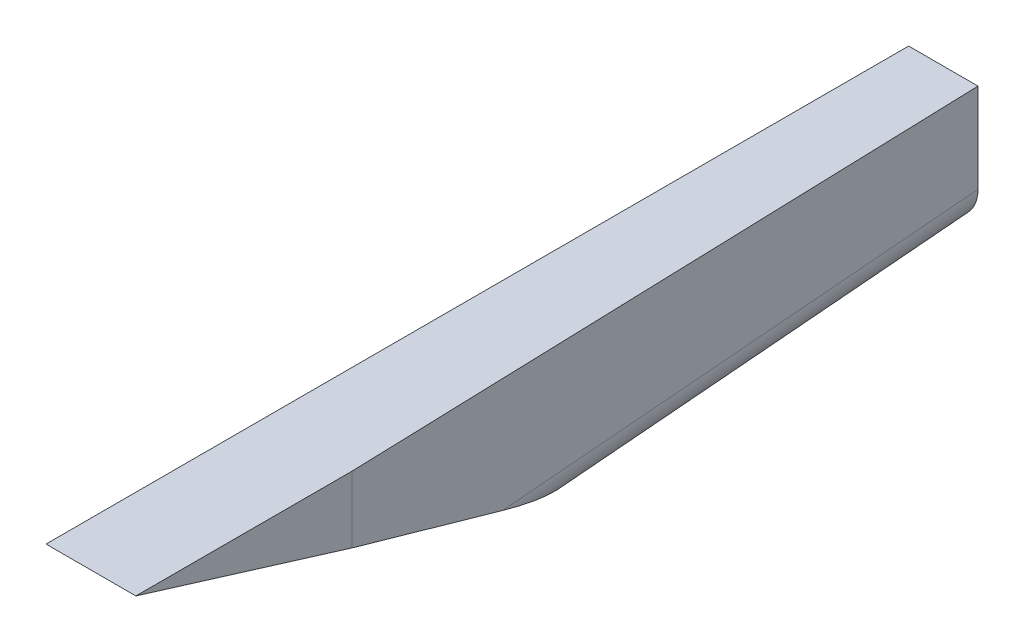
ISO-10303-21;
HEADER;
FILE_DESCRIPTION(('STEP AP214'),'2;1');
FILE_NAME('part.step','',(''),(''),'','','');
FILE_SCHEMA(('AUTOMOTIVE_DESIGN { 1 0 10303 214 1 1 1 1 }'));
ENDSEC;
DATA;
#1=APPLICATION_CONTEXT('core data for automotive mechanical design processes');
#2=APPLICATION_PROTOCOL_DEFINITION('international standard','automotive_design',2000,#1);
#3=PRODUCT_CONTEXT('',#1,'mechanical');
#4=PRODUCT('Part','Part','',(#3));
#5=PRODUCT_RELATED_PRODUCT_CATEGORY('part','',(#4));
#6=PRODUCT_DEFINITION_FORMATION('','',#4);
#7=PRODUCT_DEFINITION_CONTEXT('part definition',#1,'design');
#8=PRODUCT_DEFINITION('design','',#6,#7);
#9=PRODUCT_DEFINITION_SHAPE('','',#8);
#10=(LENGTH_UNIT() NAMED_UNIT(*) SI_UNIT(.MILLI.,.METRE.));
#11=(NAMED_UNIT(*) PLANE_ANGLE_UNIT() SI_UNIT($,.RADIAN.));
#12=(NAMED_UNIT(*) SI_UNIT($,.STERADIAN.) SOLID_ANGLE_UNIT());
#13=UNCERTAINTY_MEASURE_WITH_UNIT(LENGTH_MEASURE(1.E-05),#10,'distance_accuracy_value','');
#14=(GEOMETRIC_REPRESENTATION_CONTEXT(3) GLOBAL_UNCERTAINTY_ASSIGNED_CONTEXT((#13)) GLOBAL_UNIT_ASSIGNED_CONTEXT((#10,
#11,#12)) REPRESENTATION_CONTEXT('',''));
#15=CARTESIAN_POINT('',(0.,0.,0.));
#16=DIRECTION('',(0.,0.,1.));
#17=DIRECTION('',(1.,0.,0.));
#18=AXIS2_PLACEMENT_3D('',#15,#16,#17);
#19=CARTESIAN_POINT('',(0.,0.,-584.2));
#20=DIRECTION('',(0.,0.,1.));
#21=DIRECTION('',(1.,0.,0.));
#22=AXIS2_PLACEMENT_3D('',#19,#20,#21);
#23=PLANE('',#22);
#24=DIRECTION('',(1.,0.,0.));
#25=VECTOR('',#24,1.);
#26=CARTESIAN_POINT('',(0.,5.96900000000002,-584.2));
#27=LINE('',#26,#25);
#28=CARTESIAN_POINT('',(18.161,5.96900000000002,-584.2));
#29=VERTEX_POINT('',#28);
#30=CARTESIAN_POINT('',(42.6703226354349,5.96900000000002,-584.2));
#31=VERTEX_POINT('',#30);
#32=EDGE_CURVE('E48',#29,#31,#27,.T.);
#33=ORIENTED_EDGE('',*,*,#32,.T.);
#34=DIRECTION('',(0.,1.,0.));
#35=VECTOR('',#34,1.);
#36=CARTESIAN_POINT('',(42.6703226354349,0.,-584.2));
#37=LINE('',#36,#35);
#38=CARTESIAN_POINT('',(42.6703226354349,-25.6299972610752,-584.2));
#39=VERTEX_POINT('',#38);
#40=EDGE_CURVE('E121',#39,#31,#37,.T.);
#41=ORIENTED_EDGE('',*,*,#40,.F.);
#42=CARTESIAN_POINT('',(29.9639479786131,-25.6096034762046,-584.2));
#43=DIRECTION('',(0.,0.,1.));
#44=DIRECTION('',(0.52999894000318,-0.847998304005088,0.));
#45=AXIS2_PLACEMENT_3D('',#42,#43,#44);
#46=ELLIPSE('',#45,12.7226792238703,12.7);
#47=CARTESIAN_POINT('',(29.9843258252833,-38.3259162166958,-584.2));
#48=VERTEX_POINT('',#47);
#49=EDGE_CURVE('E11',#39,#48,#46,.F.);
#50=ORIENTED_EDGE('',*,*,#49,.T.);
#51=DIRECTION('',(1.,0.,0.));
#52=VECTOR('',#51,1.);
#53=CARTESIAN_POINT('',(0.,-38.3259162166958,-584.2));
#54=LINE('',#53,#52);
#55=CARTESIAN_POINT('',(18.161,-38.3259162166958,-584.2));
#56=VERTEX_POINT('',#55);
#57=EDGE_CURVE('E60',#56,#48,#54,.T.);
#58=ORIENTED_EDGE('',*,*,#57,.F.);
#59=DIRECTION('',(0.,-1.,0.));
#60=VECTOR('',#59,1.);
#61=CARTESIAN_POINT('',(18.161,0.,-584.2));
#62=LINE('',#61,#60);
#63=EDGE_CURVE('E141',#29,#56,#62,.T.);
#64=ORIENTED_EDGE('',*,*,#63,.F.);
#65=EDGE_LOOP('',(#33,#41,#50,#58,#64));
#66=FACE_BOUND('',#65,.T.);
#67=ADVANCED_FACE('F45',(#66),#23,.F.);
#68=CARTESIAN_POINT('',(-18.171,5.96900771473894,-279.4));
#69=DIRECTION('',(0.,0.955805662169999,-0.293999211161814));
#70=DIRECTION('',(0.,0.293999211161814,0.95580566217));
#71=AXIS2_PLACEMENT_3D('',#68,#69,#70);
#72=PLANE('',#71);
#73=CARTESIAN_POINT('',(49.911,5.96900000000001,-279.40002508099));
#74=DIRECTION('',(-1.,0.,0.));
#75=VECTOR('',#74,1.);
#76=LINE('',#73,#75);
#77=CARTESIAN_POINT('',(49.911,5.96900000000002,-279.400012540495));
#78=VERTEX_POINT('',#77);
#79=CARTESIAN_POINT('',(18.161,5.96900000000002,-279.400012540495));
#80=VERTEX_POINT('',#79);
#81=EDGE_CURVE('E106',#78,#80,#76,.T.);
#82=ORIENTED_EDGE('',*,*,#81,.T.);
#83=DIRECTION('',(0.,0.293999211161814,0.95580566217));
#84=VECTOR('',#83,1.);
#85=CARTESIAN_POINT('',(18.161,83.9661806626817,-25.8274164468259));
#86=LINE('',#85,#84);
#87=CARTESIAN_POINT('',(18.161,-45.324750584507,-446.158490346475));
#88=VERTEX_POINT('',#87);
#89=EDGE_CURVE('E149',#88,#80,#86,.T.);
#90=ORIENTED_EDGE('',*,*,#89,.F.);
#91=DIRECTION('',(1.,0.,0.));
#92=VECTOR('',#91,1.);
#93=CARTESIAN_POINT('',(-18.171,-45.324750584507,-446.158490346475));
#94=LINE('',#93,#92);
#95=CARTESIAN_POINT('',(34.3585973051654,-45.324750584507,-446.158490346475));
#96=VERTEX_POINT('',#95);
#97=EDGE_CURVE('E155',#88,#96,#94,.T.);
#98=ORIENTED_EDGE('',*,*,#97,.T.);
#99=CARTESIAN_POINT('',(35.4628701850894,-34.4078790065666,-410.667212576906));
#100=DIRECTION('',(0.,0.955805662169999,-0.293999211161814));
#101=DIRECTION('',(0.0336594162159993,0.293832619834028,0.955264065701976));
#102=AXIS2_PLACEMENT_3D('',#99,#100,#101);
#103=ELLIPSE('',#102,37.1509063553258,12.7);
#104=CARTESIAN_POINT('',(48.1674411834576,-34.4253869379114,-410.72413170892));
#105=VERTEX_POINT('',#104);
#106=EDGE_CURVE('E132',#96,#105,#103,.F.);
#107=ORIENTED_EDGE('',*,*,#106,.T.);
#108=DIRECTION('',(-0.0302737712385389,-0.293864454960091,-0.955367563237315));
#109=VECTOR('',#108,1.);
#110=CARTESIAN_POINT('',(60.3087583408269,83.4291585310044,-27.5733013835216));
#111=LINE('',#110,#109);
#112=CARTESIAN_POINT('',(49.911,-17.500836729847,-355.7016));
#113=VERTEX_POINT('',#112);
#114=EDGE_CURVE('E191',#113,#105,#111,.T.);
#115=ORIENTED_EDGE('',*,*,#114,.F.);
#116=DIRECTION('',(0.,-0.293999211161814,-0.95580566217));
#117=VECTOR('',#116,1.);
#118=CARTESIAN_POINT('',(49.911,86.7896518290421,-16.648175056632));
#119=LINE('',#118,#117);
#120=EDGE_CURVE('E114',#78,#113,#119,.T.);
#121=ORIENTED_EDGE('',*,*,#120,.F.);
#122=EDGE_LOOP('',(#82,#90,#98,#107,#115,#121));
#123=FACE_BOUND('',#122,.T.);
#124=ADVANCED_FACE('F154',(#123),#72,.F.);
#125=CARTESIAN_POINT('',(0.,5.96900000000002,0.));
#126=DIRECTION('',(0.,1.,0.));
#127=DIRECTION('',(0.,0.,1.));
#128=AXIS2_PLACEMENT_3D('',#125,#126,#127);
#129=PLANE('',#128);
#130=ORIENTED_EDGE('',*,*,#32,.F.);
#131=DIRECTION('',(0.,0.,1.));
#132=VECTOR('',#131,1.);
#133=CARTESIAN_POINT('',(18.161,5.96900000000002,0.));
#134=LINE('',#133,#132);
#135=EDGE_CURVE('E109',#29,#80,#134,.T.);
#136=ORIENTED_EDGE('',*,*,#135,.T.);
#137=ORIENTED_EDGE('',*,*,#81,.F.);
#138=DIRECTION('',(0.,0.,-1.));
#139=VECTOR('',#138,1.);
#140=CARTESIAN_POINT('',(49.911,5.96900000000002,25.4));
#141=LINE('',#140,#139);
#142=CARTESIAN_POINT('',(49.911,5.96900000000002,-355.7016));
#143=VERTEX_POINT('',#142);
#144=EDGE_CURVE('E99',#78,#143,#141,.T.);
#145=ORIENTED_EDGE('',*,*,#144,.T.);
#146=DIRECTION('',(-0.0316721902279269,0.,-0.999498310336824));
#147=VECTOR('',#146,1.);
#148=CARTESIAN_POINT('',(61.1211296763861,5.96900000000002,-1.93681172447798));
#149=LINE('',#148,#147);
#150=EDGE_CURVE('E104',#143,#31,#149,.T.);
#151=ORIENTED_EDGE('',*,*,#150,.T.);
#152=EDGE_LOOP('',(#130,#136,#137,#145,#151));
#153=FACE_BOUND('',#152,.T.);
#154=ADVANCED_FACE('F102',(#153),#129,.T.);
#155=CARTESIAN_POINT('',(49.911,-49.911,25.4));
#156=DIRECTION('',(-1.,0.,0.));
#157=DIRECTION('',(0.,0.,1.));
#158=AXIS2_PLACEMENT_3D('',#155,#156,#157);
#159=PLANE('',#158);
#160=ORIENTED_EDGE('',*,*,#144,.F.);
#161=ORIENTED_EDGE('',*,*,#120,.T.);
#162=DIRECTION('',(0.,1.,0.));
#163=VECTOR('',#162,1.);
#164=CARTESIAN_POINT('',(49.911,-49.911,-355.7016));
#165=LINE('',#164,#163);
#166=EDGE_CURVE('E112',#113,#143,#165,.T.);
#167=ORIENTED_EDGE('',*,*,#166,.T.);
#168=EDGE_LOOP('',(#160,#161,#167));
#169=FACE_BOUND('',#168,.T.);
#170=ADVANCED_FACE('F113',(#169),#159,.F.);
#171=CARTESIAN_POINT('',(61.1211296763861,0.,-1.93681172447798));
#172=DIRECTION('',(-0.999498310336824,0.,0.0316721902279269));
#173=DIRECTION('',(0.0316721902279269,0.,0.999498310336824));
#174=AXIS2_PLACEMENT_3D('',#171,#172,#173);
#175=PLANE('',#174);
#176=DIRECTION('',(0.0316316011868878,-0.0506105618990205,0.99821741761533));
#177=VECTOR('',#176,1.);
#178=CARTESIAN_POINT('',(61.0328383585854,-55.010022418116,-4.72307381510543));
#179=LINE('',#178,#177);
#180=EDGE_CURVE('E128',#105,#39,#179,.F.);
#181=ORIENTED_EDGE('',*,*,#180,.T.);
#182=ORIENTED_EDGE('',*,*,#40,.T.);
#183=ORIENTED_EDGE('',*,*,#150,.F.);
#184=ORIENTED_EDGE('',*,*,#166,.F.);
#185=ORIENTED_EDGE('',*,*,#114,.T.);
#186=EDGE_LOOP('',(#181,#182,#183,#184,#185));
#187=FACE_BOUND('',#186,.T.);
#188=ADVANCED_FACE('F120',(#187),#175,.F.);
#189=CARTESIAN_POINT('',(18.161,0.,0.));
#190=DIRECTION('',(1.,0.,0.));
#191=DIRECTION('',(0.,0.,-1.));
#192=AXIS2_PLACEMENT_3D('',#189,#190,#191);
#193=PLANE('',#192);
#194=ORIENTED_EDGE('',*,*,#135,.F.);
#195=ORIENTED_EDGE('',*,*,#63,.T.);
#196=DIRECTION('',(0.,0.0506359003212277,-0.998717179985735));
#197=VECTOR('',#196,1.);
#198=CARTESIAN_POINT('',(18.161,-67.7711940185204,-3.43606327571275));
#199=LINE('',#198,#197);
#200=EDGE_CURVE('E131',#88,#56,#199,.T.);
#201=ORIENTED_EDGE('',*,*,#200,.F.);
#202=ORIENTED_EDGE('',*,*,#89,.T.);
#203=EDGE_LOOP('',(#194,#195,#201,#202));
#204=FACE_BOUND('',#203,.T.);
#205=ADVANCED_FACE('F146',(#204),#193,.F.);
#206=CARTESIAN_POINT('',(0.,-67.7711940185204,-3.43606327571275));
#207=DIRECTION('',(0.,0.998717179985735,0.0506359003212277));
#208=DIRECTION('',(0.,-0.0506359003212277,0.998717179985735));
#209=AXIS2_PLACEMENT_3D('',#206,#207,#208);
#210=PLANE('',#209);
#211=ORIENTED_EDGE('',*,*,#200,.T.);
#212=ORIENTED_EDGE('',*,*,#57,.T.);
#213=DIRECTION('',(0.0316316011868878,-0.0506105618990205,0.998217417615331));
#214=VECTOR('',#213,1.);
#215=CARTESIAN_POINT('',(48.3392098173078,-67.6937306039349,-4.96391293329035));
#216=LINE('',#215,#214);
#217=EDGE_CURVE('E117',#48,#96,#216,.T.);
#218=ORIENTED_EDGE('',*,*,#217,.T.);
#219=ORIENTED_EDGE('',*,*,#97,.F.);
#220=EDGE_LOOP('',(#211,#212,#218,#219));
#221=FACE_BOUND('',#220,.T.);
#222=ADVANCED_FACE('F175',(#221),#210,.F.);
#223=CARTESIAN_POINT('',(48.3392098173078,-55.010022418116,-4.32083699921076));
#224=DIRECTION('',(0.0316316011868878,-0.0506105618990205,0.998217417615331));
#225=DIRECTION('',(0.,-0.998717179985735,-0.0506359003212277));
#226=AXIS2_PLACEMENT_3D('',#223,#224,#225);
#227=CYLINDRICAL_SURFACE('',#226,12.7);
#228=ORIENTED_EDGE('',*,*,#49,.F.);
#229=ORIENTED_EDGE('',*,*,#180,.F.);
#230=ORIENTED_EDGE('',*,*,#106,.F.);
#231=ORIENTED_EDGE('',*,*,#217,.F.);
#232=EDGE_LOOP('',(#228,#229,#230,#231));
#233=FACE_BOUND('',#232,.T.);
#234=ADVANCED_FACE('F170',(#233),#227,.T.);
#235=CLOSED_SHELL('',(#67,#124,#154,#170,#188,#205,#222,#234));
#236=MANIFOLD_SOLID_BREP('B2',#235);
#237=ADVANCED_BREP_SHAPE_REPRESENTATION('',(#18,#236),#14);
#238=SHAPE_DEFINITION_REPRESENTATION(#9,#237);
ENDSEC;
END-ISO-10303-21;
